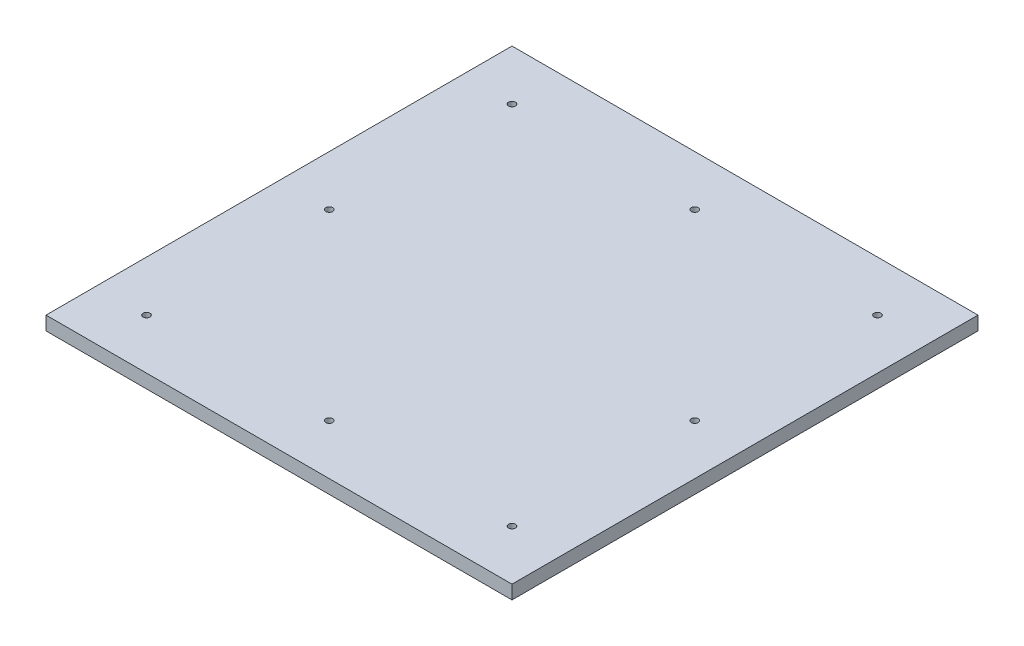
ISO-10303-21;
HEADER;
FILE_DESCRIPTION(('STEP AP214'),'2;1');
FILE_NAME('part.step','',(''),(''),'','','');
FILE_SCHEMA(('AUTOMOTIVE_DESIGN { 1 0 10303 214 1 1 1 1 }'));
ENDSEC;
DATA;
#1=APPLICATION_CONTEXT('core data for automotive mechanical design processes');
#2=APPLICATION_PROTOCOL_DEFINITION('international standard','automotive_design',2000,#1);
#3=PRODUCT_CONTEXT('',#1,'mechanical');
#4=PRODUCT('Part','Part','',(#3));
#5=PRODUCT_RELATED_PRODUCT_CATEGORY('part','',(#4));
#6=PRODUCT_DEFINITION_FORMATION('','',#4);
#7=PRODUCT_DEFINITION_CONTEXT('part definition',#1,'design');
#8=PRODUCT_DEFINITION('design','',#6,#7);
#9=PRODUCT_DEFINITION_SHAPE('','',#8);
#10=(LENGTH_UNIT() NAMED_UNIT(*) SI_UNIT(.MILLI.,.METRE.));
#11=(NAMED_UNIT(*) PLANE_ANGLE_UNIT() SI_UNIT($,.RADIAN.));
#12=(NAMED_UNIT(*) SI_UNIT($,.STERADIAN.) SOLID_ANGLE_UNIT());
#13=UNCERTAINTY_MEASURE_WITH_UNIT(LENGTH_MEASURE(1.E-05),#10,'distance_accuracy_value','');
#14=(GEOMETRIC_REPRESENTATION_CONTEXT(3) GLOBAL_UNCERTAINTY_ASSIGNED_CONTEXT((#13)) GLOBAL_UNIT_ASSIGNED_CONTEXT((#10,
#11,#12)) REPRESENTATION_CONTEXT('',''));
#15=CARTESIAN_POINT('',(0.,0.,0.));
#16=DIRECTION('',(0.,0.,1.));
#17=DIRECTION('',(1.,0.,0.));
#18=AXIS2_PLACEMENT_3D('',#15,#16,#17);
#19=CARTESIAN_POINT('',(0.,19.05,647.7));
#20=DIRECTION('',(0.,1.,0.));
#21=DIRECTION('',(0.,0.,1.));
#22=AXIS2_PLACEMENT_3D('',#19,#20,#21);
#23=PLANE('',#22);
#24=CARTESIAN_POINT('',(323.850000000005,19.05,577.85));
#25=DIRECTION('',(0.,1.,0.));
#26=DIRECTION('',(0.,0.,1.));
#27=AXIS2_PLACEMENT_3D('',#24,#25,#26);
#28=CIRCLE('',#27,4.76249999999994);
#29=CARTESIAN_POINT('',(323.850000000005,19.05,582.6125));
#30=VERTEX_POINT('',#29);
#31=EDGE_CURVE('E147',#30,#30,#28,.T.);
#32=ORIENTED_EDGE('',*,*,#31,.F.);
#33=EDGE_LOOP('',(#32));
#34=FACE_BOUND('',#33,.T.);
#35=CARTESIAN_POINT('',(577.850000000003,19.05,323.85));
#36=DIRECTION('',(0.,1.,0.));
#37=DIRECTION('',(0.,0.,1.));
#38=AXIS2_PLACEMENT_3D('',#35,#36,#37);
#39=CIRCLE('',#38,4.76249999999999);
#40=CARTESIAN_POINT('',(577.850000000003,19.05,328.6125));
#41=VERTEX_POINT('',#40);
#42=EDGE_CURVE('E135',#41,#41,#39,.T.);
#43=ORIENTED_EDGE('',*,*,#42,.F.);
#44=EDGE_LOOP('',(#43));
#45=FACE_BOUND('',#44,.T.);
#46=CARTESIAN_POINT('',(577.85,19.05,69.85));
#47=DIRECTION('',(0.,1.,0.));
#48=DIRECTION('',(0.,0.,1.));
#49=AXIS2_PLACEMENT_3D('',#46,#47,#48);
#50=CIRCLE('',#49,4.76250000000001);
#51=CARTESIAN_POINT('',(577.85,19.05,74.6125));
#52=VERTEX_POINT('',#51);
#53=EDGE_CURVE('E123',#52,#52,#50,.T.);
#54=ORIENTED_EDGE('',*,*,#53,.F.);
#55=EDGE_LOOP('',(#54));
#56=FACE_BOUND('',#55,.T.);
#57=CARTESIAN_POINT('',(69.85,19.05,69.85));
#58=DIRECTION('',(0.,1.,0.));
#59=DIRECTION('',(0.,0.,1.));
#60=AXIS2_PLACEMENT_3D('',#57,#58,#59);
#61=CIRCLE('',#60,4.7625);
#62=CARTESIAN_POINT('',(69.85,19.05,74.6125));
#63=VERTEX_POINT('',#62);
#64=EDGE_CURVE('E102',#63,#63,#61,.T.);
#65=ORIENTED_EDGE('',*,*,#64,.F.);
#66=EDGE_LOOP('',(#65));
#67=FACE_BOUND('',#66,.T.);
#68=DIRECTION('',(0.,0.,1.));
#69=VECTOR('',#68,1.);
#70=CARTESIAN_POINT('',(0.,19.05,0.));
#71=LINE('',#70,#69);
#72=CARTESIAN_POINT('',(0.,19.05,0.));
#73=VERTEX_POINT('',#72);
#74=CARTESIAN_POINT('',(0.,19.05,647.7));
#75=VERTEX_POINT('',#74);
#76=EDGE_CURVE('E87',#73,#75,#71,.T.);
#77=ORIENTED_EDGE('',*,*,#76,.T.);
#78=DIRECTION('',(1.,0.,0.));
#79=VECTOR('',#78,1.);
#80=CARTESIAN_POINT('',(0.,19.05,647.7));
#81=LINE('',#80,#79);
#82=CARTESIAN_POINT('',(647.7,19.05,647.7));
#83=VERTEX_POINT('',#82);
#84=EDGE_CURVE('E82',#75,#83,#81,.T.);
#85=ORIENTED_EDGE('',*,*,#84,.T.);
#86=DIRECTION('',(0.,0.,-1.));
#87=VECTOR('',#86,1.);
#88=CARTESIAN_POINT('',(647.7,19.05,0.));
#89=LINE('',#88,#87);
#90=CARTESIAN_POINT('',(647.7,19.05,0.));
#91=VERTEX_POINT('',#90);
#92=EDGE_CURVE('E85',#83,#91,#89,.T.);
#93=ORIENTED_EDGE('',*,*,#92,.T.);
#94=DIRECTION('',(-1.,0.,0.));
#95=VECTOR('',#94,1.);
#96=CARTESIAN_POINT('',(0.,19.05,0.));
#97=LINE('',#96,#95);
#98=EDGE_CURVE('E52',#91,#73,#97,.T.);
#99=ORIENTED_EDGE('',*,*,#98,.T.);
#100=EDGE_LOOP('',(#77,#85,#93,#99));
#101=FACE_BOUND('',#100,.T.);
#102=CARTESIAN_POINT('',(323.85,19.05,69.85));
#103=DIRECTION('',(0.,1.,0.));
#104=DIRECTION('',(0.,0.,1.));
#105=AXIS2_PLACEMENT_3D('',#102,#103,#104);
#106=CIRCLE('',#105,4.76249999999996);
#107=CARTESIAN_POINT('',(323.85,19.05,74.6125));
#108=VERTEX_POINT('',#107);
#109=EDGE_CURVE('E117',#108,#108,#106,.T.);
#110=ORIENTED_EDGE('',*,*,#109,.F.);
#111=EDGE_LOOP('',(#110));
#112=FACE_BOUND('',#111,.T.);
#113=CARTESIAN_POINT('',(69.8500000000027,19.05,323.85));
#114=DIRECTION('',(0.,1.,0.));
#115=DIRECTION('',(0.,0.,1.));
#116=AXIS2_PLACEMENT_3D('',#113,#114,#115);
#117=CIRCLE('',#116,4.76249999999998);
#118=CARTESIAN_POINT('',(69.8500000000027,19.05,328.6125));
#119=VERTEX_POINT('',#118);
#120=EDGE_CURVE('E129',#119,#119,#117,.T.);
#121=ORIENTED_EDGE('',*,*,#120,.F.);
#122=EDGE_LOOP('',(#121));
#123=FACE_BOUND('',#122,.T.);
#124=CARTESIAN_POINT('',(69.8500000000053,19.05,577.85));
#125=DIRECTION('',(0.,1.,0.));
#126=DIRECTION('',(0.,0.,1.));
#127=AXIS2_PLACEMENT_3D('',#124,#125,#126);
#128=CIRCLE('',#127,4.76249999999998);
#129=CARTESIAN_POINT('',(69.8500000000053,19.05,582.6125));
#130=VERTEX_POINT('',#129);
#131=EDGE_CURVE('E141',#130,#130,#128,.T.);
#132=ORIENTED_EDGE('',*,*,#131,.F.);
#133=EDGE_LOOP('',(#132));
#134=FACE_BOUND('',#133,.T.);
#135=CARTESIAN_POINT('',(577.850000000005,19.05,577.85));
#136=DIRECTION('',(0.,1.,0.));
#137=DIRECTION('',(0.,0.,1.));
#138=AXIS2_PLACEMENT_3D('',#135,#136,#137);
#139=CIRCLE('',#138,4.76249999999999);
#140=CARTESIAN_POINT('',(577.850000000005,19.05,582.6125));
#141=VERTEX_POINT('',#140);
#142=EDGE_CURVE('E153',#141,#141,#139,.T.);
#143=ORIENTED_EDGE('',*,*,#142,.F.);
#144=EDGE_LOOP('',(#143));
#145=FACE_BOUND('',#144,.T.);
#146=ADVANCED_FACE('F35',(#34,#45,#56,#67,#101,#112,#123,#134,#145),#23,.T.);
#147=CARTESIAN_POINT('',(0.,0.,647.7));
#148=DIRECTION('',(0.,1.,0.));
#149=DIRECTION('',(0.,0.,1.));
#150=AXIS2_PLACEMENT_3D('',#147,#148,#149);
#151=PLANE('',#150);
#152=CARTESIAN_POINT('',(323.850000000005,0.,577.85));
#153=DIRECTION('',(0.,1.,0.));
#154=DIRECTION('',(0.,0.,1.));
#155=AXIS2_PLACEMENT_3D('',#152,#153,#154);
#156=CIRCLE('',#155,4.76249999999994);
#157=CARTESIAN_POINT('',(323.850000000005,0.,582.6125));
#158=VERTEX_POINT('',#157);
#159=EDGE_CURVE('E150',#158,#158,#156,.T.);
#160=ORIENTED_EDGE('',*,*,#159,.T.);
#161=EDGE_LOOP('',(#160));
#162=FACE_BOUND('',#161,.T.);
#163=CARTESIAN_POINT('',(577.850000000003,0.,323.85));
#164=DIRECTION('',(0.,1.,0.));
#165=DIRECTION('',(0.,0.,1.));
#166=AXIS2_PLACEMENT_3D('',#163,#164,#165);
#167=CIRCLE('',#166,4.76249999999999);
#168=CARTESIAN_POINT('',(577.850000000003,0.,328.6125));
#169=VERTEX_POINT('',#168);
#170=EDGE_CURVE('E138',#169,#169,#167,.T.);
#171=ORIENTED_EDGE('',*,*,#170,.T.);
#172=EDGE_LOOP('',(#171));
#173=FACE_BOUND('',#172,.T.);
#174=CARTESIAN_POINT('',(577.85,0.,69.85));
#175=DIRECTION('',(0.,1.,0.));
#176=DIRECTION('',(0.,0.,1.));
#177=AXIS2_PLACEMENT_3D('',#174,#175,#176);
#178=CIRCLE('',#177,4.76250000000001);
#179=CARTESIAN_POINT('',(577.85,0.,74.6125));
#180=VERTEX_POINT('',#179);
#181=EDGE_CURVE('E126',#180,#180,#178,.T.);
#182=ORIENTED_EDGE('',*,*,#181,.T.);
#183=EDGE_LOOP('',(#182));
#184=FACE_BOUND('',#183,.T.);
#185=CARTESIAN_POINT('',(69.85,0.,69.85));
#186=DIRECTION('',(0.,1.,0.));
#187=DIRECTION('',(0.,0.,1.));
#188=AXIS2_PLACEMENT_3D('',#185,#186,#187);
#189=CIRCLE('',#188,4.7625);
#190=CARTESIAN_POINT('',(69.85,0.,74.6125));
#191=VERTEX_POINT('',#190);
#192=EDGE_CURVE('E114',#191,#191,#189,.T.);
#193=ORIENTED_EDGE('',*,*,#192,.T.);
#194=EDGE_LOOP('',(#193));
#195=FACE_BOUND('',#194,.T.);
#196=DIRECTION('',(0.,0.,1.));
#197=VECTOR('',#196,1.);
#198=CARTESIAN_POINT('',(0.,0.,0.));
#199=LINE('',#198,#197);
#200=CARTESIAN_POINT('',(0.,0.,0.));
#201=VERTEX_POINT('',#200);
#202=CARTESIAN_POINT('',(0.,0.,647.7));
#203=VERTEX_POINT('',#202);
#204=EDGE_CURVE('E99',#201,#203,#199,.T.);
#205=ORIENTED_EDGE('',*,*,#204,.F.);
#206=DIRECTION('',(-1.,0.,0.));
#207=VECTOR('',#206,1.);
#208=CARTESIAN_POINT('',(0.,0.,0.));
#209=LINE('',#208,#207);
#210=CARTESIAN_POINT('',(647.7,0.,0.));
#211=VERTEX_POINT('',#210);
#212=EDGE_CURVE('E75',#211,#201,#209,.T.);
#213=ORIENTED_EDGE('',*,*,#212,.F.);
#214=DIRECTION('',(0.,0.,-1.));
#215=VECTOR('',#214,1.);
#216=CARTESIAN_POINT('',(647.7,0.,0.));
#217=LINE('',#216,#215);
#218=CARTESIAN_POINT('',(647.7,0.,647.7));
#219=VERTEX_POINT('',#218);
#220=EDGE_CURVE('E69',#219,#211,#217,.T.);
#221=ORIENTED_EDGE('',*,*,#220,.F.);
#222=DIRECTION('',(1.,0.,0.));
#223=VECTOR('',#222,1.);
#224=CARTESIAN_POINT('',(0.,0.,647.7));
#225=LINE('',#224,#223);
#226=EDGE_CURVE('E91',#203,#219,#225,.T.);
#227=ORIENTED_EDGE('',*,*,#226,.F.);
#228=EDGE_LOOP('',(#205,#213,#221,#227));
#229=FACE_BOUND('',#228,.T.);
#230=CARTESIAN_POINT('',(323.85,0.,69.85));
#231=DIRECTION('',(0.,1.,0.));
#232=DIRECTION('',(0.,0.,1.));
#233=AXIS2_PLACEMENT_3D('',#230,#231,#232);
#234=CIRCLE('',#233,4.76249999999996);
#235=CARTESIAN_POINT('',(323.85,0.,74.6125));
#236=VERTEX_POINT('',#235);
#237=EDGE_CURVE('E120',#236,#236,#234,.T.);
#238=ORIENTED_EDGE('',*,*,#237,.T.);
#239=EDGE_LOOP('',(#238));
#240=FACE_BOUND('',#239,.T.);
#241=CARTESIAN_POINT('',(69.8500000000027,0.,323.85));
#242=DIRECTION('',(0.,1.,0.));
#243=DIRECTION('',(0.,0.,1.));
#244=AXIS2_PLACEMENT_3D('',#241,#242,#243);
#245=CIRCLE('',#244,4.76249999999998);
#246=CARTESIAN_POINT('',(69.8500000000027,0.,328.6125));
#247=VERTEX_POINT('',#246);
#248=EDGE_CURVE('E132',#247,#247,#245,.T.);
#249=ORIENTED_EDGE('',*,*,#248,.T.);
#250=EDGE_LOOP('',(#249));
#251=FACE_BOUND('',#250,.T.);
#252=CARTESIAN_POINT('',(69.8500000000053,0.,577.85));
#253=DIRECTION('',(0.,1.,0.));
#254=DIRECTION('',(0.,0.,1.));
#255=AXIS2_PLACEMENT_3D('',#252,#253,#254);
#256=CIRCLE('',#255,4.76249999999998);
#257=CARTESIAN_POINT('',(69.8500000000053,0.,582.6125));
#258=VERTEX_POINT('',#257);
#259=EDGE_CURVE('E144',#258,#258,#256,.T.);
#260=ORIENTED_EDGE('',*,*,#259,.T.);
#261=EDGE_LOOP('',(#260));
#262=FACE_BOUND('',#261,.T.);
#263=CARTESIAN_POINT('',(577.850000000005,0.,577.85));
#264=DIRECTION('',(0.,1.,0.));
#265=DIRECTION('',(0.,0.,1.));
#266=AXIS2_PLACEMENT_3D('',#263,#264,#265);
#267=CIRCLE('',#266,4.76249999999999);
#268=CARTESIAN_POINT('',(577.850000000005,0.,582.6125));
#269=VERTEX_POINT('',#268);
#270=EDGE_CURVE('E156',#269,#269,#267,.T.);
#271=ORIENTED_EDGE('',*,*,#270,.T.);
#272=EDGE_LOOP('',(#271));
#273=FACE_BOUND('',#272,.T.);
#274=ADVANCED_FACE('F110',(#162,#173,#184,#195,#229,#240,#251,#262,#273),#151,.F.);
#275=CARTESIAN_POINT('',(0.,19.05,0.));
#276=DIRECTION('',(1.,0.,0.));
#277=DIRECTION('',(0.,0.,-1.));
#278=AXIS2_PLACEMENT_3D('',#275,#276,#277);
#279=PLANE('',#278);
#280=ORIENTED_EDGE('',*,*,#204,.T.);
#281=DIRECTION('',(0.,-1.,0.));
#282=VECTOR('',#281,1.);
#283=CARTESIAN_POINT('',(0.,19.05,647.7));
#284=LINE('',#283,#282);
#285=EDGE_CURVE('E11',#75,#203,#284,.T.);
#286=ORIENTED_EDGE('',*,*,#285,.F.);
#287=ORIENTED_EDGE('',*,*,#76,.F.);
#288=DIRECTION('',(0.,-1.,0.));
#289=VECTOR('',#288,1.);
#290=CARTESIAN_POINT('',(0.,19.05,0.));
#291=LINE('',#290,#289);
#292=EDGE_CURVE('E95',#73,#201,#291,.T.);
#293=ORIENTED_EDGE('',*,*,#292,.T.);
#294=EDGE_LOOP('',(#280,#286,#287,#293));
#295=FACE_BOUND('',#294,.T.);
#296=ADVANCED_FACE('F37',(#295),#279,.F.);
#297=CARTESIAN_POINT('',(0.,19.05,647.7));
#298=DIRECTION('',(0.,0.,-1.));
#299=DIRECTION('',(-1.,0.,0.));
#300=AXIS2_PLACEMENT_3D('',#297,#298,#299);
#301=PLANE('',#300);
#302=ORIENTED_EDGE('',*,*,#226,.T.);
#303=DIRECTION('',(0.,-1.,0.));
#304=VECTOR('',#303,1.);
#305=CARTESIAN_POINT('',(647.7,19.05,647.7));
#306=LINE('',#305,#304);
#307=EDGE_CURVE('E44',#83,#219,#306,.T.);
#308=ORIENTED_EDGE('',*,*,#307,.F.);
#309=ORIENTED_EDGE('',*,*,#84,.F.);
#310=ORIENTED_EDGE('',*,*,#285,.T.);
#311=EDGE_LOOP('',(#302,#308,#309,#310));
#312=FACE_BOUND('',#311,.T.);
#313=ADVANCED_FACE('F90',(#312),#301,.F.);
#314=CARTESIAN_POINT('',(647.7,19.05,0.));
#315=DIRECTION('',(-1.,0.,0.));
#316=DIRECTION('',(0.,0.,1.));
#317=AXIS2_PLACEMENT_3D('',#314,#315,#316);
#318=PLANE('',#317);
#319=ORIENTED_EDGE('',*,*,#220,.T.);
#320=DIRECTION('',(0.,-1.,0.));
#321=VECTOR('',#320,1.);
#322=CARTESIAN_POINT('',(647.7,19.05,0.));
#323=LINE('',#322,#321);
#324=EDGE_CURVE('E92',#91,#211,#323,.T.);
#325=ORIENTED_EDGE('',*,*,#324,.F.);
#326=ORIENTED_EDGE('',*,*,#92,.F.);
#327=ORIENTED_EDGE('',*,*,#307,.T.);
#328=EDGE_LOOP('',(#319,#325,#326,#327));
#329=FACE_BOUND('',#328,.T.);
#330=ADVANCED_FACE('F93',(#329),#318,.F.);
#331=CARTESIAN_POINT('',(0.,19.05,0.));
#332=DIRECTION('',(0.,0.,1.));
#333=DIRECTION('',(1.,0.,0.));
#334=AXIS2_PLACEMENT_3D('',#331,#332,#333);
#335=PLANE('',#334);
#336=ORIENTED_EDGE('',*,*,#212,.T.);
#337=ORIENTED_EDGE('',*,*,#292,.F.);
#338=ORIENTED_EDGE('',*,*,#98,.F.);
#339=ORIENTED_EDGE('',*,*,#324,.T.);
#340=EDGE_LOOP('',(#336,#337,#338,#339));
#341=FACE_BOUND('',#340,.T.);
#342=ADVANCED_FACE('F107',(#341),#335,.F.);
#343=CARTESIAN_POINT('',(69.85,19.05,69.85));
#344=DIRECTION('',(0.,-1.,0.));
#345=DIRECTION('',(0.,0.,-1.));
#346=AXIS2_PLACEMENT_3D('',#343,#344,#345);
#347=CYLINDRICAL_SURFACE('',#346,4.7625);
#348=ORIENTED_EDGE('',*,*,#64,.T.);
#349=EDGE_LOOP('',(#348));
#350=FACE_BOUND('',#349,.T.);
#351=ORIENTED_EDGE('',*,*,#192,.F.);
#352=EDGE_LOOP('',(#351));
#353=FACE_BOUND('',#352,.T.);
#354=ADVANCED_FACE('F176',(#350,#353),#347,.F.);
#355=CARTESIAN_POINT('',(323.85,19.05,69.85));
#356=DIRECTION('',(0.,-1.,0.));
#357=DIRECTION('',(0.,0.,-1.));
#358=AXIS2_PLACEMENT_3D('',#355,#356,#357);
#359=CYLINDRICAL_SURFACE('',#358,4.76249999999996);
#360=ORIENTED_EDGE('',*,*,#109,.T.);
#361=EDGE_LOOP('',(#360));
#362=FACE_BOUND('',#361,.T.);
#363=ORIENTED_EDGE('',*,*,#237,.F.);
#364=EDGE_LOOP('',(#363));
#365=FACE_BOUND('',#364,.T.);
#366=ADVANCED_FACE('F222',(#362,#365),#359,.F.);
#367=CARTESIAN_POINT('',(577.85,19.05,69.85));
#368=DIRECTION('',(0.,-1.,0.));
#369=DIRECTION('',(0.,0.,-1.));
#370=AXIS2_PLACEMENT_3D('',#367,#368,#369);
#371=CYLINDRICAL_SURFACE('',#370,4.76250000000001);
#372=ORIENTED_EDGE('',*,*,#53,.T.);
#373=EDGE_LOOP('',(#372));
#374=FACE_BOUND('',#373,.T.);
#375=ORIENTED_EDGE('',*,*,#181,.F.);
#376=EDGE_LOOP('',(#375));
#377=FACE_BOUND('',#376,.T.);
#378=ADVANCED_FACE('F230',(#374,#377),#371,.F.);
#379=CARTESIAN_POINT('',(69.8500000000027,19.05,323.85));
#380=DIRECTION('',(0.,-1.,0.));
#381=DIRECTION('',(0.,0.,-1.));
#382=AXIS2_PLACEMENT_3D('',#379,#380,#381);
#383=CYLINDRICAL_SURFACE('',#382,4.76249999999998);
#384=ORIENTED_EDGE('',*,*,#120,.T.);
#385=EDGE_LOOP('',(#384));
#386=FACE_BOUND('',#385,.T.);
#387=ORIENTED_EDGE('',*,*,#248,.F.);
#388=EDGE_LOOP('',(#387));
#389=FACE_BOUND('',#388,.T.);
#390=ADVANCED_FACE('F238',(#386,#389),#383,.F.);
#391=CARTESIAN_POINT('',(577.850000000003,19.05,323.85));
#392=DIRECTION('',(0.,-1.,0.));
#393=DIRECTION('',(0.,0.,-1.));
#394=AXIS2_PLACEMENT_3D('',#391,#392,#393);
#395=CYLINDRICAL_SURFACE('',#394,4.76249999999999);
#396=ORIENTED_EDGE('',*,*,#42,.T.);
#397=EDGE_LOOP('',(#396));
#398=FACE_BOUND('',#397,.T.);
#399=ORIENTED_EDGE('',*,*,#170,.F.);
#400=EDGE_LOOP('',(#399));
#401=FACE_BOUND('',#400,.T.);
#402=ADVANCED_FACE('F247',(#398,#401),#395,.F.);
#403=CARTESIAN_POINT('',(69.8500000000053,19.05,577.85));
#404=DIRECTION('',(0.,-1.,0.));
#405=DIRECTION('',(0.,0.,-1.));
#406=AXIS2_PLACEMENT_3D('',#403,#404,#405);
#407=CYLINDRICAL_SURFACE('',#406,4.76249999999998);
#408=ORIENTED_EDGE('',*,*,#131,.T.);
#409=EDGE_LOOP('',(#408));
#410=FACE_BOUND('',#409,.T.);
#411=ORIENTED_EDGE('',*,*,#259,.F.);
#412=EDGE_LOOP('',(#411));
#413=FACE_BOUND('',#412,.T.);
#414=ADVANCED_FACE('F256',(#410,#413),#407,.F.);
#415=CARTESIAN_POINT('',(323.850000000005,19.05,577.85));
#416=DIRECTION('',(0.,-1.,0.));
#417=DIRECTION('',(0.,0.,-1.));
#418=AXIS2_PLACEMENT_3D('',#415,#416,#417);
#419=CYLINDRICAL_SURFACE('',#418,4.76249999999994);
#420=ORIENTED_EDGE('',*,*,#31,.T.);
#421=EDGE_LOOP('',(#420));
#422=FACE_BOUND('',#421,.T.);
#423=ORIENTED_EDGE('',*,*,#159,.F.);
#424=EDGE_LOOP('',(#423));
#425=FACE_BOUND('',#424,.T.);
#426=ADVANCED_FACE('F265',(#422,#425),#419,.F.);
#427=CARTESIAN_POINT('',(577.850000000005,19.05,577.85));
#428=DIRECTION('',(0.,-1.,0.));
#429=DIRECTION('',(0.,0.,-1.));
#430=AXIS2_PLACEMENT_3D('',#427,#428,#429);
#431=CYLINDRICAL_SURFACE('',#430,4.76249999999999);
#432=ORIENTED_EDGE('',*,*,#142,.T.);
#433=EDGE_LOOP('',(#432));
#434=FACE_BOUND('',#433,.T.);
#435=ORIENTED_EDGE('',*,*,#270,.F.);
#436=EDGE_LOOP('',(#435));
#437=FACE_BOUND('',#436,.T.);
#438=ADVANCED_FACE('F162',(#434,#437),#431,.F.);
#439=CLOSED_SHELL('',(#146,#274,#296,#313,#330,#342,#354,#366,#378,#390,#402,#414,#426,#438));
#440=MANIFOLD_SOLID_BREP('B2',#439);
#441=ADVANCED_BREP_SHAPE_REPRESENTATION('',(#18,#440),#14);
#442=SHAPE_DEFINITION_REPRESENTATION(#9,#441);
ENDSEC;
END-ISO-10303-21;
